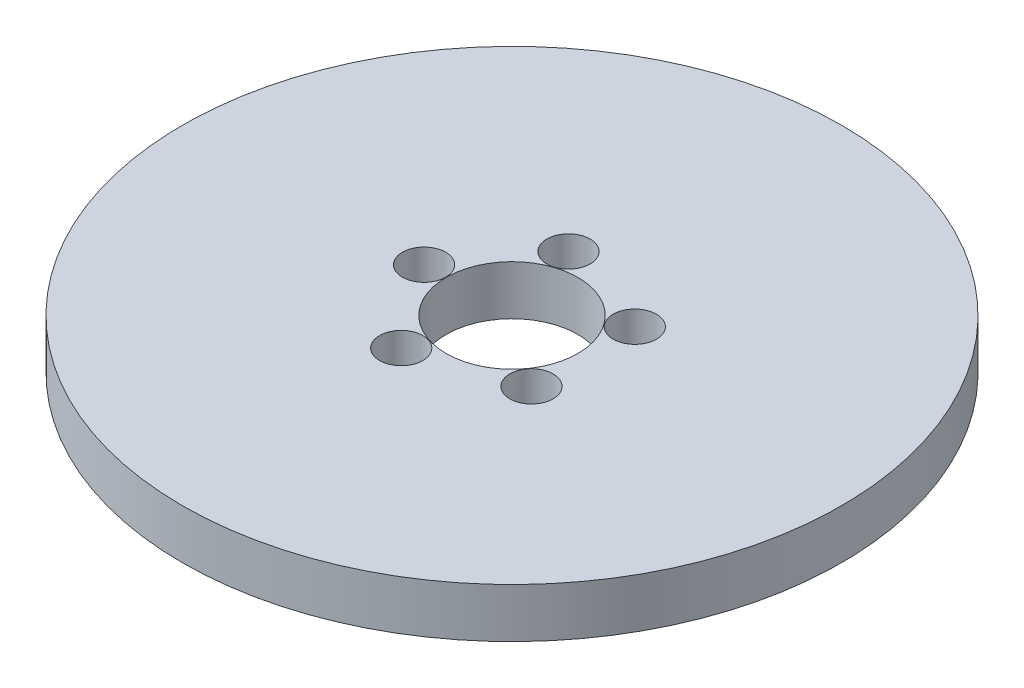
ISO-10303-21;
HEADER;
FILE_DESCRIPTION(('STEP AP214'),'2;1');
FILE_NAME('part.step','',(''),(''),'','','');
FILE_SCHEMA(('AUTOMOTIVE_DESIGN { 1 0 10303 214 1 1 1 1 }'));
ENDSEC;
DATA;
#1=APPLICATION_CONTEXT('core data for automotive mechanical design processes');
#2=APPLICATION_PROTOCOL_DEFINITION('international standard','automotive_design',2000,#1);
#3=PRODUCT_CONTEXT('',#1,'mechanical');
#4=PRODUCT('Part','Part','',(#3));
#5=PRODUCT_RELATED_PRODUCT_CATEGORY('part','',(#4));
#6=PRODUCT_DEFINITION_FORMATION('','',#4);
#7=PRODUCT_DEFINITION_CONTEXT('part definition',#1,'design');
#8=PRODUCT_DEFINITION('design','',#6,#7);
#9=PRODUCT_DEFINITION_SHAPE('','',#8);
#10=(LENGTH_UNIT() NAMED_UNIT(*) SI_UNIT(.MILLI.,.METRE.));
#11=(NAMED_UNIT(*) PLANE_ANGLE_UNIT() SI_UNIT($,.RADIAN.));
#12=(NAMED_UNIT(*) SI_UNIT($,.STERADIAN.) SOLID_ANGLE_UNIT());
#13=UNCERTAINTY_MEASURE_WITH_UNIT(LENGTH_MEASURE(1.E-05),#10,'distance_accuracy_value','');
#14=(GEOMETRIC_REPRESENTATION_CONTEXT(3) GLOBAL_UNCERTAINTY_ASSIGNED_CONTEXT((#13)) GLOBAL_UNIT_ASSIGNED_CONTEXT((#10,
#11,#12)) REPRESENTATION_CONTEXT('',''));
#15=CARTESIAN_POINT('',(0.,0.,0.));
#16=DIRECTION('',(0.,0.,1.));
#17=DIRECTION('',(1.,0.,0.));
#18=AXIS2_PLACEMENT_3D('',#15,#16,#17);
#19=CARTESIAN_POINT('',(0.,15.,0.));
#20=DIRECTION('',(0.,-1.,0.));
#21=DIRECTION('',(0.,0.,-1.));
#22=AXIS2_PLACEMENT_3D('',#19,#20,#21);
#23=CYLINDRICAL_SURFACE('',#22,100.);
#24=CARTESIAN_POINT('',(0.,15.,0.));
#25=DIRECTION('',(0.,1.,0.));
#26=DIRECTION('',(0.,0.,1.));
#27=AXIS2_PLACEMENT_3D('',#24,#25,#26);
#28=CIRCLE('',#27,100.);
#29=CARTESIAN_POINT('',(0.,15.,100.));
#30=VERTEX_POINT('',#29);
#31=EDGE_CURVE('E10',#30,#30,#28,.T.);
#32=ORIENTED_EDGE('',*,*,#31,.F.);
#33=EDGE_LOOP('',(#32));
#34=FACE_BOUND('',#33,.T.);
#35=CARTESIAN_POINT('',(0.,0.,0.));
#36=DIRECTION('',(0.,1.,0.));
#37=DIRECTION('',(0.,0.,1.));
#38=AXIS2_PLACEMENT_3D('',#35,#36,#37);
#39=CIRCLE('',#38,100.);
#40=CARTESIAN_POINT('',(0.,0.,100.));
#41=VERTEX_POINT('',#40);
#42=EDGE_CURVE('E37',#41,#41,#39,.T.);
#43=ORIENTED_EDGE('',*,*,#42,.T.);
#44=EDGE_LOOP('',(#43));
#45=FACE_BOUND('',#44,.T.);
#46=ADVANCED_FACE('F40',(#34,#45),#23,.T.);
#47=CARTESIAN_POINT('',(0.,15.,0.));
#48=DIRECTION('',(0.,1.,0.));
#49=DIRECTION('',(0.,0.,1.));
#50=AXIS2_PLACEMENT_3D('',#47,#48,#49);
#51=PLANE('',#50);
#52=CARTESIAN_POINT('',(-8.24391941749728,15.,-25.3721750730298));
#53=DIRECTION('',(0.,1.,0.));
#54=DIRECTION('',(-0.95105651629515,0.,0.309016994374958));
#55=AXIS2_PLACEMENT_3D('',#52,#53,#54);
#56=CIRCLE('',#55,6.5715694069799);
#57=CARTESIAN_POINT('',(-14.4938533242914,15.,-23.3414484465585));
#58=VERTEX_POINT('',#57);
#59=EDGE_CURVE('E70',#58,#58,#56,.T.);
#60=ORIENTED_EDGE('',*,*,#59,.F.);
#61=EDGE_LOOP('',(#60));
#62=FACE_BOUND('',#61,.T.);
#63=CARTESIAN_POINT('',(21.5828612355222,15.,-15.6808665636455));
#64=DIRECTION('',(0.,1.,0.));
#65=DIRECTION('',(-0.58778525229248,0.,-0.809016994374942));
#66=AXIS2_PLACEMENT_3D('',#63,#64,#65);
#67=CIRCLE('',#66,6.5715694069799);
#68=CARTESIAN_POINT('',(17.720189653683,15.,-20.9973778936067));
#69=VERTEX_POINT('',#68);
#70=EDGE_CURVE('E71',#69,#69,#67,.T.);
#71=ORIENTED_EDGE('',*,*,#70,.F.);
#72=EDGE_LOOP('',(#71));
#73=FACE_BOUND('',#72,.T.);
#74=CARTESIAN_POINT('',(21.5828612355225,15.,15.6808665636452));
#75=DIRECTION('',(0.,1.,0.));
#76=DIRECTION('',(0.587785252292469,0.,-0.809016994374951));
#77=AXIS2_PLACEMENT_3D('',#74,#75,#76);
#78=CIRCLE('',#77,6.5715694069799);
#79=CARTESIAN_POINT('',(25.4455328173616,15.,10.364355233684));
#80=VERTEX_POINT('',#79);
#81=EDGE_CURVE('E78',#80,#80,#78,.T.);
#82=ORIENTED_EDGE('',*,*,#81,.F.);
#83=EDGE_LOOP('',(#82));
#84=FACE_BOUND('',#83,.T.);
#85=CARTESIAN_POINT('',(-8.24391941749693,15.,25.3721750730299));
#86=DIRECTION('',(0.,1.,0.));
#87=DIRECTION('',(0.951056516295155,0.,0.309016994374945));
#88=AXIS2_PLACEMENT_3D('',#85,#86,#87);
#89=CIRCLE('',#88,6.5715694069799);
#90=CARTESIAN_POINT('',(-1.99398551070281,15.,27.4029016995012));
#91=VERTEX_POINT('',#90);
#92=EDGE_CURVE('E61',#91,#91,#89,.T.);
#93=ORIENTED_EDGE('',*,*,#92,.F.);
#94=EDGE_LOOP('',(#93));
#95=FACE_BOUND('',#94,.T.);
#96=CARTESIAN_POINT('',(-26.6778836360508,15.,0.));
#97=DIRECTION('',(0.,1.,0.));
#98=DIRECTION('',(0.,0.,1.));
#99=AXIS2_PLACEMENT_3D('',#96,#97,#98);
#100=CIRCLE('',#99,6.5715694069799);
#101=CARTESIAN_POINT('',(-26.6778836360508,15.,6.5715694069799));
#102=VERTEX_POINT('',#101);
#103=EDGE_CURVE('E54',#102,#102,#100,.T.);
#104=ORIENTED_EDGE('',*,*,#103,.F.);
#105=EDGE_LOOP('',(#104));
#106=FACE_BOUND('',#105,.T.);
#107=CARTESIAN_POINT('',(0.,15.,0.));
#108=DIRECTION('',(0.,1.,0.));
#109=DIRECTION('',(0.,0.,1.));
#110=AXIS2_PLACEMENT_3D('',#107,#108,#109);
#111=CIRCLE('',#110,20.);
#112=CARTESIAN_POINT('',(0.,15.,20.));
#113=VERTEX_POINT('',#112);
#114=EDGE_CURVE('E50',#113,#113,#111,.T.);
#115=ORIENTED_EDGE('',*,*,#114,.F.);
#116=EDGE_LOOP('',(#115));
#117=FACE_BOUND('',#116,.T.);
#118=ORIENTED_EDGE('',*,*,#31,.T.);
#119=EDGE_LOOP('',(#118));
#120=FACE_BOUND('',#119,.T.);
#121=ADVANCED_FACE('F94',(#62,#73,#84,#95,#106,#117,#120),#51,.T.);
#122=CARTESIAN_POINT('',(0.,0.,0.));
#123=DIRECTION('',(0.,1.,0.));
#124=DIRECTION('',(0.,0.,1.));
#125=AXIS2_PLACEMENT_3D('',#122,#123,#124);
#126=PLANE('',#125);
#127=CARTESIAN_POINT('',(0.,0.,0.));
#128=DIRECTION('',(0.,1.,0.));
#129=DIRECTION('',(0.,0.,1.));
#130=AXIS2_PLACEMENT_3D('',#127,#128,#129);
#131=CIRCLE('',#130,20.);
#132=CARTESIAN_POINT('',(0.,0.,20.));
#133=VERTEX_POINT('',#132);
#134=EDGE_CURVE('E47',#133,#133,#131,.T.);
#135=ORIENTED_EDGE('',*,*,#134,.T.);
#136=EDGE_LOOP('',(#135));
#137=FACE_BOUND('',#136,.T.);
#138=ORIENTED_EDGE('',*,*,#42,.F.);
#139=EDGE_LOOP('',(#138));
#140=FACE_BOUND('',#139,.T.);
#141=ADVANCED_FACE('F100',(#137,#140),#126,.F.);
#142=CARTESIAN_POINT('',(0.,15.,0.));
#143=DIRECTION('',(0.,-1.,0.));
#144=DIRECTION('',(0.,0.,-1.));
#145=AXIS2_PLACEMENT_3D('',#142,#143,#144);
#146=CYLINDRICAL_SURFACE('',#145,20.);
#147=ORIENTED_EDGE('',*,*,#114,.T.);
#148=EDGE_LOOP('',(#147));
#149=FACE_BOUND('',#148,.T.);
#150=ORIENTED_EDGE('',*,*,#134,.F.);
#151=EDGE_LOOP('',(#150));
#152=FACE_BOUND('',#151,.T.);
#153=ADVANCED_FACE('F106',(#149,#152),#146,.F.);
#154=CARTESIAN_POINT('',(-26.6778836360508,1.08233827683942,0.));
#155=DIRECTION('',(0.,1.,0.));
#156=DIRECTION('',(0.,0.,1.));
#157=AXIS2_PLACEMENT_3D('',#154,#155,#156);
#158=CYLINDRICAL_SURFACE('',#157,6.5715694069799);
#159=CARTESIAN_POINT('',(-26.6778836360508,1.08233827683942,0.));
#160=DIRECTION('',(0.,1.,0.));
#161=DIRECTION('',(0.,0.,1.));
#162=AXIS2_PLACEMENT_3D('',#159,#160,#161);
#163=CIRCLE('',#162,6.5715694069799);
#164=CARTESIAN_POINT('',(-26.6778836360508,1.08233827683942,6.5715694069799));
#165=VERTEX_POINT('',#164);
#166=EDGE_CURVE('E55',#165,#165,#163,.T.);
#167=ORIENTED_EDGE('',*,*,#166,.F.);
#168=EDGE_LOOP('',(#167));
#169=FACE_BOUND('',#168,.T.);
#170=ORIENTED_EDGE('',*,*,#103,.T.);
#171=EDGE_LOOP('',(#170));
#172=FACE_BOUND('',#171,.T.);
#173=ADVANCED_FACE('F108',(#169,#172),#158,.F.);
#174=CARTESIAN_POINT('',(-26.6778836360508,1.08233827683942,0.));
#175=DIRECTION('',(0.,1.,0.));
#176=DIRECTION('',(0.,0.,1.));
#177=AXIS2_PLACEMENT_3D('',#174,#175,#176);
#178=PLANE('',#177);
#179=ORIENTED_EDGE('',*,*,#166,.T.);
#180=EDGE_LOOP('',(#179));
#181=FACE_BOUND('',#180,.T.);
#182=ADVANCED_FACE('F138',(#181),#178,.T.);
#183=CARTESIAN_POINT('',(-8.24391941749693,1.08233827683942,25.3721750730299));
#184=DIRECTION('',(0.,1.,0.));
#185=DIRECTION('',(0.,0.,1.));
#186=AXIS2_PLACEMENT_3D('',#183,#184,#185);
#187=CYLINDRICAL_SURFACE('',#186,6.5715694069799);
#188=CARTESIAN_POINT('',(-8.24391941749693,1.08233827683942,25.3721750730299));
#189=DIRECTION('',(0.,1.,0.));
#190=DIRECTION('',(0.951056516295155,0.,0.309016994374945));
#191=AXIS2_PLACEMENT_3D('',#188,#189,#190);
#192=CIRCLE('',#191,6.5715694069799);
#193=CARTESIAN_POINT('',(-1.99398551070281,1.08233827683942,27.4029016995012));
#194=VERTEX_POINT('',#193);
#195=EDGE_CURVE('E59',#194,#194,#192,.T.);
#196=ORIENTED_EDGE('',*,*,#195,.F.);
#197=EDGE_LOOP('',(#196));
#198=FACE_BOUND('',#197,.T.);
#199=ORIENTED_EDGE('',*,*,#92,.T.);
#200=EDGE_LOOP('',(#199));
#201=FACE_BOUND('',#200,.T.);
#202=ADVANCED_FACE('F150',(#198,#201),#187,.F.);
#203=CARTESIAN_POINT('',(-8.24391941749693,1.08233827683942,25.3721750730299));
#204=DIRECTION('',(0.,1.,0.));
#205=DIRECTION('',(0.951056516295155,0.,0.309016994374945));
#206=AXIS2_PLACEMENT_3D('',#203,#204,#205);
#207=PLANE('',#206);
#208=ORIENTED_EDGE('',*,*,#195,.T.);
#209=EDGE_LOOP('',(#208));
#210=FACE_BOUND('',#209,.T.);
#211=ADVANCED_FACE('F89',(#210),#207,.T.);
#212=CARTESIAN_POINT('',(21.5828612355225,1.08233827683942,15.6808665636452));
#213=DIRECTION('',(0.,1.,0.));
#214=DIRECTION('',(0.,0.,1.));
#215=AXIS2_PLACEMENT_3D('',#212,#213,#214);
#216=CYLINDRICAL_SURFACE('',#215,6.5715694069799);
#217=CARTESIAN_POINT('',(21.5828612355225,1.08233827683942,15.6808665636452));
#218=DIRECTION('',(0.,1.,0.));
#219=DIRECTION('',(0.587785252292469,0.,-0.809016994374951));
#220=AXIS2_PLACEMENT_3D('',#217,#218,#219);
#221=CIRCLE('',#220,6.5715694069799);
#222=CARTESIAN_POINT('',(25.4455328173616,1.08233827683942,10.364355233684));
#223=VERTEX_POINT('',#222);
#224=EDGE_CURVE('E63',#223,#223,#221,.T.);
#225=ORIENTED_EDGE('',*,*,#224,.F.);
#226=EDGE_LOOP('',(#225));
#227=FACE_BOUND('',#226,.T.);
#228=ORIENTED_EDGE('',*,*,#81,.T.);
#229=EDGE_LOOP('',(#228));
#230=FACE_BOUND('',#229,.T.);
#231=ADVANCED_FACE('F87',(#227,#230),#216,.F.);
#232=CARTESIAN_POINT('',(21.5828612355225,1.08233827683942,15.6808665636452));
#233=DIRECTION('',(0.,1.,0.));
#234=DIRECTION('',(0.587785252292469,0.,-0.809016994374951));
#235=AXIS2_PLACEMENT_3D('',#232,#233,#234);
#236=PLANE('',#235);
#237=ORIENTED_EDGE('',*,*,#224,.T.);
#238=EDGE_LOOP('',(#237));
#239=FACE_BOUND('',#238,.T.);
#240=ADVANCED_FACE('F84',(#239),#236,.T.);
#241=CARTESIAN_POINT('',(21.5828612355222,1.08233827683942,-15.6808665636455));
#242=DIRECTION('',(0.,1.,0.));
#243=DIRECTION('',(0.,0.,1.));
#244=AXIS2_PLACEMENT_3D('',#241,#242,#243);
#245=CYLINDRICAL_SURFACE('',#244,6.5715694069799);
#246=CARTESIAN_POINT('',(21.5828612355222,1.08233827683942,-15.6808665636455));
#247=DIRECTION('',(0.,1.,0.));
#248=DIRECTION('',(-0.58778525229248,0.,-0.809016994374942));
#249=AXIS2_PLACEMENT_3D('',#246,#247,#248);
#250=CIRCLE('',#249,6.5715694069799);
#251=CARTESIAN_POINT('',(17.720189653683,1.08233827683942,-20.9973778936067));
#252=VERTEX_POINT('',#251);
#253=EDGE_CURVE('E76',#252,#252,#250,.T.);
#254=ORIENTED_EDGE('',*,*,#253,.F.);
#255=EDGE_LOOP('',(#254));
#256=FACE_BOUND('',#255,.T.);
#257=ORIENTED_EDGE('',*,*,#70,.T.);
#258=EDGE_LOOP('',(#257));
#259=FACE_BOUND('',#258,.T.);
#260=ADVANCED_FACE('F185',(#256,#259),#245,.F.);
#261=CARTESIAN_POINT('',(21.5828612355222,1.08233827683942,-15.6808665636455));
#262=DIRECTION('',(0.,1.,0.));
#263=DIRECTION('',(-0.58778525229248,0.,-0.809016994374942));
#264=AXIS2_PLACEMENT_3D('',#261,#262,#263);
#265=PLANE('',#264);
#266=ORIENTED_EDGE('',*,*,#253,.T.);
#267=EDGE_LOOP('',(#266));
#268=FACE_BOUND('',#267,.T.);
#269=ADVANCED_FACE('F189',(#268),#265,.T.);
#270=CARTESIAN_POINT('',(-8.24391941749728,1.08233827683942,-25.3721750730298));
#271=DIRECTION('',(0.,1.,0.));
#272=DIRECTION('',(0.,0.,1.));
#273=AXIS2_PLACEMENT_3D('',#270,#271,#272);
#274=CYLINDRICAL_SURFACE('',#273,6.5715694069799);
#275=CARTESIAN_POINT('',(-8.24391941749728,1.08233827683942,-25.3721750730298));
#276=DIRECTION('',(0.,1.,0.));
#277=DIRECTION('',(-0.95105651629515,0.,0.309016994374958));
#278=AXIS2_PLACEMENT_3D('',#275,#276,#277);
#279=CIRCLE('',#278,6.5715694069799);
#280=CARTESIAN_POINT('',(-14.4938533242914,1.08233827683942,-23.3414484465585));
#281=VERTEX_POINT('',#280);
#282=EDGE_CURVE('E69',#281,#281,#279,.T.);
#283=ORIENTED_EDGE('',*,*,#282,.F.);
#284=EDGE_LOOP('',(#283));
#285=FACE_BOUND('',#284,.T.);
#286=ORIENTED_EDGE('',*,*,#59,.T.);
#287=EDGE_LOOP('',(#286));
#288=FACE_BOUND('',#287,.T.);
#289=ADVANCED_FACE('F200',(#285,#288),#274,.F.);
#290=CARTESIAN_POINT('',(-8.24391941749728,1.08233827683942,-25.3721750730298));
#291=DIRECTION('',(0.,1.,0.));
#292=DIRECTION('',(-0.95105651629515,0.,0.309016994374958));
#293=AXIS2_PLACEMENT_3D('',#290,#291,#292);
#294=PLANE('',#293);
#295=ORIENTED_EDGE('',*,*,#282,.T.);
#296=EDGE_LOOP('',(#295));
#297=FACE_BOUND('',#296,.T.);
#298=ADVANCED_FACE('F208',(#297),#294,.T.);
#299=CLOSED_SHELL('',(#46,#121,#141,#153,#173,#182,#202,#211,#231,#240,#260,#269,#289,#298));
#300=MANIFOLD_SOLID_BREP('B2',#299);
#301=ADVANCED_BREP_SHAPE_REPRESENTATION('',(#18,#300),#14);
#302=SHAPE_DEFINITION_REPRESENTATION(#9,#301);
ENDSEC;
END-ISO-10303-21;
